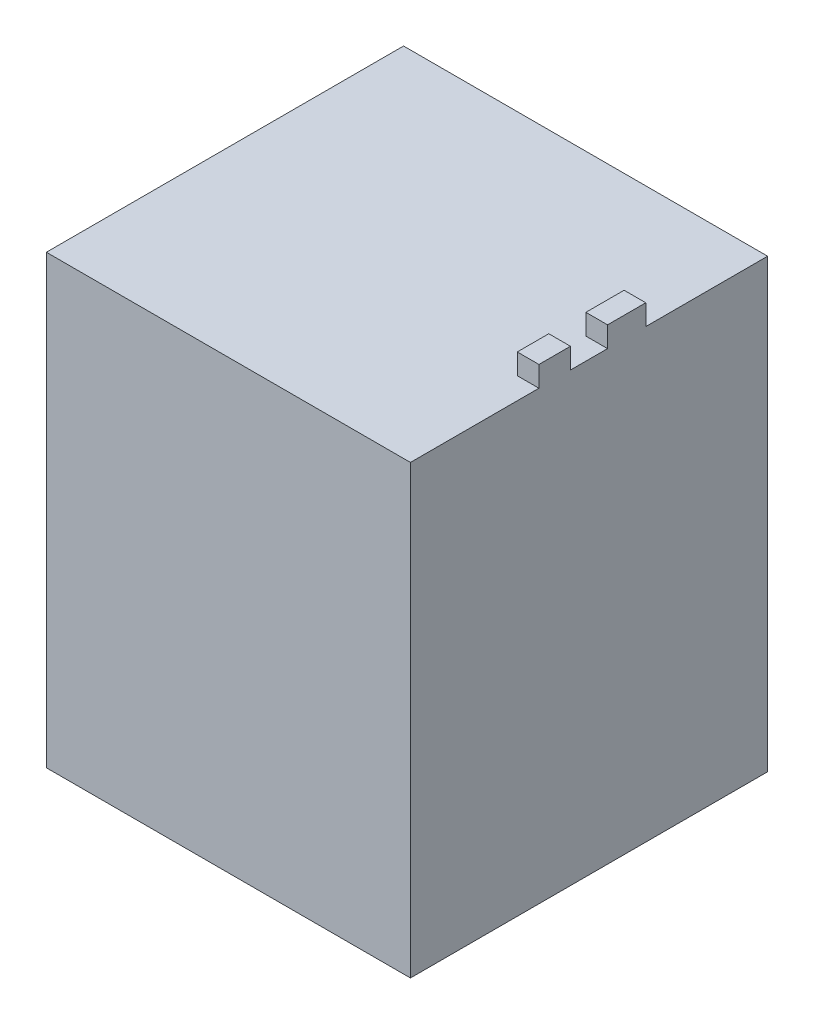
ISO-10303-21;
HEADER;
FILE_DESCRIPTION(('STEP AP214'),'2;1');
FILE_NAME('part.step','',(''),(''),'','','');
FILE_SCHEMA(('AUTOMOTIVE_DESIGN { 1 0 10303 214 1 1 1 1 }'));
ENDSEC;
DATA;
#1=APPLICATION_CONTEXT('core data for automotive mechanical design processes');
#2=APPLICATION_PROTOCOL_DEFINITION('international standard','automotive_design',2000,#1);
#3=PRODUCT_CONTEXT('',#1,'mechanical');
#4=PRODUCT('Part','Part','',(#3));
#5=PRODUCT_RELATED_PRODUCT_CATEGORY('part','',(#4));
#6=PRODUCT_DEFINITION_FORMATION('','',#4);
#7=PRODUCT_DEFINITION_CONTEXT('part definition',#1,'design');
#8=PRODUCT_DEFINITION('design','',#6,#7);
#9=PRODUCT_DEFINITION_SHAPE('','',#8);
#10=(LENGTH_UNIT() NAMED_UNIT(*) SI_UNIT(.MILLI.,.METRE.));
#11=(NAMED_UNIT(*) PLANE_ANGLE_UNIT() SI_UNIT($,.RADIAN.));
#12=(NAMED_UNIT(*) SI_UNIT($,.STERADIAN.) SOLID_ANGLE_UNIT());
#13=UNCERTAINTY_MEASURE_WITH_UNIT(LENGTH_MEASURE(1.E-05),#10,'distance_accuracy_value','');
#14=(GEOMETRIC_REPRESENTATION_CONTEXT(3) GLOBAL_UNCERTAINTY_ASSIGNED_CONTEXT((#13)) GLOBAL_UNIT_ASSIGNED_CONTEXT((#10,
#11,#12)) REPRESENTATION_CONTEXT('',''));
#15=CARTESIAN_POINT('',(0.,0.,0.));
#16=DIRECTION('',(0.,0.,1.));
#17=DIRECTION('',(1.,0.,0.));
#18=AXIS2_PLACEMENT_3D('',#15,#16,#17);
#19=CARTESIAN_POINT('',(0.,65.,0.));
#20=DIRECTION('',(0.,1.,0.));
#21=DIRECTION('',(0.,0.,1.));
#22=AXIS2_PLACEMENT_3D('',#19,#20,#21);
#23=PLANE('',#22);
#24=DIRECTION('',(0.,0.,1.));
#25=VECTOR('',#24,1.);
#26=CARTESIAN_POINT('',(37.4181346575853,65.,-10.1187209788094));
#27=LINE('',#26,#25);
#28=CARTESIAN_POINT('',(37.4181346575853,65.,-10.1187209788094));
#29=VERTEX_POINT('',#28);
#30=CARTESIAN_POINT('',(37.4181346575853,65.,-5.53067615751246));
#31=VERTEX_POINT('',#30);
#32=EDGE_CURVE('E354',#29,#31,#27,.T.);
#33=ORIENTED_EDGE('',*,*,#32,.F.);
#34=DIRECTION('',(-1.,0.,0.));
#35=VECTOR('',#34,1.);
#36=CARTESIAN_POINT('',(40.5734463276836,65.,-10.1187209788094));
#37=LINE('',#36,#35);
#38=CARTESIAN_POINT('',(40.5734463276836,65.,-10.1187209788094));
#39=VERTEX_POINT('',#38);
#40=EDGE_CURVE('E225',#39,#29,#37,.T.);
#41=ORIENTED_EDGE('',*,*,#40,.F.);
#42=DIRECTION('',(0.,0.,-1.));
#43=VECTOR('',#42,1.);
#44=CARTESIAN_POINT('',(40.5734463276836,65.,-38.8248587570622));
#45=LINE('',#44,#43);
#46=CARTESIAN_POINT('',(40.5734463276836,65.,-15.5208446142581));
#47=VERTEX_POINT('',#46);
#48=EDGE_CURVE('E149',#39,#47,#45,.T.);
#49=ORIENTED_EDGE('',*,*,#48,.T.);
#50=DIRECTION('',(1.,0.,0.));
#51=VECTOR('',#50,1.);
#52=CARTESIAN_POINT('',(40.5734463276836,65.,-15.5208446142581));
#53=LINE('',#52,#51);
#54=CARTESIAN_POINT('',(37.4181346575853,65.,-15.5208446142581));
#55=VERTEX_POINT('',#54);
#56=EDGE_CURVE('E59',#55,#47,#53,.T.);
#57=ORIENTED_EDGE('',*,*,#56,.F.);
#58=DIRECTION('',(0.,0.,1.));
#59=VECTOR('',#58,1.);
#60=CARTESIAN_POINT('',(37.4181346575853,65.,-21.0836012163469));
#61=LINE('',#60,#59);
#62=CARTESIAN_POINT('',(37.4181346575853,65.,-21.0836012163469));
#63=VERTEX_POINT('',#62);
#64=EDGE_CURVE('E153',#63,#55,#61,.T.);
#65=ORIENTED_EDGE('',*,*,#64,.F.);
#66=DIRECTION('',(-1.,0.,0.));
#67=VECTOR('',#66,1.);
#68=CARTESIAN_POINT('',(40.5734463276836,65.,-21.0836012163469));
#69=LINE('',#68,#67);
#70=CARTESIAN_POINT('',(40.5734463276836,65.,-21.0836012163469));
#71=VERTEX_POINT('',#70);
#72=EDGE_CURVE('E150',#71,#63,#69,.T.);
#73=ORIENTED_EDGE('',*,*,#72,.F.);
#74=CARTESIAN_POINT('',(40.5734463276836,65.,-38.8248587570622));
#75=VERTEX_POINT('',#74);
#76=EDGE_CURVE('E187',#71,#75,#45,.T.);
#77=ORIENTED_EDGE('',*,*,#76,.T.);
#78=DIRECTION('',(-1.,0.,0.));
#79=VECTOR('',#78,1.);
#80=CARTESIAN_POINT('',(-12.4265536723164,65.,-38.8248587570622));
#81=LINE('',#80,#79);
#82=CARTESIAN_POINT('',(-12.4265536723164,65.,-38.8248587570622));
#83=VERTEX_POINT('',#82);
#84=EDGE_CURVE('E191',#75,#83,#81,.T.);
#85=ORIENTED_EDGE('',*,*,#84,.T.);
#86=DIRECTION('',(0.,0.,1.));
#87=VECTOR('',#86,1.);
#88=CARTESIAN_POINT('',(-12.4265536723164,65.,-38.8248587570622));
#89=LINE('',#88,#87);
#90=CARTESIAN_POINT('',(-12.4265536723164,65.,13.1751412429378));
#91=VERTEX_POINT('',#90);
#92=EDGE_CURVE('E181',#83,#91,#89,.T.);
#93=ORIENTED_EDGE('',*,*,#92,.T.);
#94=DIRECTION('',(1.,0.,0.));
#95=VECTOR('',#94,1.);
#96=CARTESIAN_POINT('',(-12.4265536723164,65.,13.1751412429378));
#97=LINE('',#96,#95);
#98=CARTESIAN_POINT('',(40.5734463276836,65.,13.1751412429378));
#99=VERTEX_POINT('',#98);
#100=EDGE_CURVE('E184',#91,#99,#97,.T.);
#101=ORIENTED_EDGE('',*,*,#100,.T.);
#102=CARTESIAN_POINT('',(40.5734463276836,65.,-5.53067615751246));
#103=VERTEX_POINT('',#102);
#104=EDGE_CURVE('E188',#99,#103,#45,.T.);
#105=ORIENTED_EDGE('',*,*,#104,.T.);
#106=DIRECTION('',(1.,0.,0.));
#107=VECTOR('',#106,1.);
#108=CARTESIAN_POINT('',(40.5734463276836,65.,-5.53067615751246));
#109=LINE('',#108,#107);
#110=EDGE_CURVE('E144',#31,#103,#109,.T.);
#111=ORIENTED_EDGE('',*,*,#110,.F.);
#112=EDGE_LOOP('',(#33,#41,#49,#57,#65,#73,#77,#85,#93,#101,#105,#111));
#113=FACE_BOUND('',#112,.T.);
#114=ADVANCED_FACE('F36',(#113),#23,.T.);
#115=CARTESIAN_POINT('',(-12.4265536723164,65.,-38.8248587570622));
#116=DIRECTION('',(1.,0.,0.));
#117=DIRECTION('',(0.,0.,-1.));
#118=AXIS2_PLACEMENT_3D('',#115,#116,#117);
#119=PLANE('',#118);
#120=DIRECTION('',(0.,0.,1.));
#121=VECTOR('',#120,1.);
#122=CARTESIAN_POINT('',(-12.4265536723164,0.,-38.8248587570622));
#123=LINE('',#122,#121);
#124=CARTESIAN_POINT('',(-12.4265536723164,0.,-38.8248587570622));
#125=VERTEX_POINT('',#124);
#126=CARTESIAN_POINT('',(-12.4265536723164,0.,13.1751412429378));
#127=VERTEX_POINT('',#126);
#128=EDGE_CURVE('E180',#125,#127,#123,.T.);
#129=ORIENTED_EDGE('',*,*,#128,.T.);
#130=DIRECTION('',(0.,-1.,0.));
#131=VECTOR('',#130,1.);
#132=CARTESIAN_POINT('',(-12.4265536723164,65.,13.1751412429378));
#133=LINE('',#132,#131);
#134=EDGE_CURVE('E11',#91,#127,#133,.T.);
#135=ORIENTED_EDGE('',*,*,#134,.F.);
#136=ORIENTED_EDGE('',*,*,#92,.F.);
#137=DIRECTION('',(0.,-1.,0.));
#138=VECTOR('',#137,1.);
#139=CARTESIAN_POINT('',(-12.4265536723164,65.,-38.8248587570622));
#140=LINE('',#139,#138);
#141=EDGE_CURVE('E193',#83,#125,#140,.T.);
#142=ORIENTED_EDGE('',*,*,#141,.T.);
#143=EDGE_LOOP('',(#129,#135,#136,#142));
#144=FACE_BOUND('',#143,.T.);
#145=ADVANCED_FACE('F38',(#144),#119,.F.);
#146=CARTESIAN_POINT('',(-12.4265536723164,65.,13.1751412429378));
#147=DIRECTION('',(0.,0.,-1.));
#148=DIRECTION('',(-1.,0.,0.));
#149=AXIS2_PLACEMENT_3D('',#146,#147,#148);
#150=PLANE('',#149);
#151=DIRECTION('',(1.,0.,0.));
#152=VECTOR('',#151,1.);
#153=CARTESIAN_POINT('',(-12.4265536723164,0.,13.1751412429378));
#154=LINE('',#153,#152);
#155=CARTESIAN_POINT('',(40.5734463276836,0.,13.1751412429378));
#156=VERTEX_POINT('',#155);
#157=EDGE_CURVE('E196',#127,#156,#154,.T.);
#158=ORIENTED_EDGE('',*,*,#157,.T.);
#159=DIRECTION('',(0.,-1.,0.));
#160=VECTOR('',#159,1.);
#161=CARTESIAN_POINT('',(40.5734463276836,65.,13.1751412429378));
#162=LINE('',#161,#160);
#163=EDGE_CURVE('E44',#99,#156,#162,.T.);
#164=ORIENTED_EDGE('',*,*,#163,.F.);
#165=ORIENTED_EDGE('',*,*,#100,.F.);
#166=ORIENTED_EDGE('',*,*,#134,.T.);
#167=EDGE_LOOP('',(#158,#164,#165,#166));
#168=FACE_BOUND('',#167,.T.);
#169=ADVANCED_FACE('F253',(#168),#150,.F.);
#170=CARTESIAN_POINT('',(40.5734463276836,65.,-38.8248587570622));
#171=DIRECTION('',(-1.,0.,0.));
#172=DIRECTION('',(0.,0.,1.));
#173=AXIS2_PLACEMENT_3D('',#170,#171,#172);
#174=PLANE('',#173);
#175=DIRECTION('',(0.,0.,-1.));
#176=VECTOR('',#175,1.);
#177=CARTESIAN_POINT('',(40.5734463276836,0.,-38.8248587570622));
#178=LINE('',#177,#176);
#179=CARTESIAN_POINT('',(40.5734463276836,0.,-38.8248587570622));
#180=VERTEX_POINT('',#179);
#181=EDGE_CURVE('E198',#156,#180,#178,.T.);
#182=ORIENTED_EDGE('',*,*,#181,.T.);
#183=DIRECTION('',(0.,-1.,0.));
#184=VECTOR('',#183,1.);
#185=CARTESIAN_POINT('',(40.5734463276836,65.,-38.8248587570622));
#186=LINE('',#185,#184);
#187=EDGE_CURVE('E203',#75,#180,#186,.T.);
#188=ORIENTED_EDGE('',*,*,#187,.F.);
#189=ORIENTED_EDGE('',*,*,#76,.F.);
#190=DIRECTION('',(0.,-1.,0.));
#191=VECTOR('',#190,1.);
#192=CARTESIAN_POINT('',(40.5734463276836,68.,-21.0836012163469));
#193=LINE('',#192,#191);
#194=CARTESIAN_POINT('',(40.5734463276836,68.,-21.0836012163469));
#195=VERTEX_POINT('',#194);
#196=EDGE_CURVE('E177',#195,#71,#193,.T.);
#197=ORIENTED_EDGE('',*,*,#196,.F.);
#198=DIRECTION('',(0.,0.,-1.));
#199=VECTOR('',#198,1.);
#200=CARTESIAN_POINT('',(40.5734463276836,68.,-21.0836012163469));
#201=LINE('',#200,#199);
#202=CARTESIAN_POINT('',(40.5734463276836,68.,-15.5208446142581));
#203=VERTEX_POINT('',#202);
#204=EDGE_CURVE('E158',#203,#195,#201,.T.);
#205=ORIENTED_EDGE('',*,*,#204,.F.);
#206=DIRECTION('',(0.,-1.,0.));
#207=VECTOR('',#206,1.);
#208=CARTESIAN_POINT('',(40.5734463276836,68.,-15.5208446142581));
#209=LINE('',#208,#207);
#210=EDGE_CURVE('E166',#203,#47,#209,.T.);
#211=ORIENTED_EDGE('',*,*,#210,.T.);
#212=ORIENTED_EDGE('',*,*,#48,.F.);
#213=DIRECTION('',(0.,-1.,0.));
#214=VECTOR('',#213,1.);
#215=CARTESIAN_POINT('',(40.5734463276836,68.,-10.1187209788094));
#216=LINE('',#215,#214);
#217=CARTESIAN_POINT('',(40.5734463276836,68.,-10.1187209788094));
#218=VERTEX_POINT('',#217);
#219=EDGE_CURVE('E129',#218,#39,#216,.T.);
#220=ORIENTED_EDGE('',*,*,#219,.F.);
#221=DIRECTION('',(0.,0.,-1.));
#222=VECTOR('',#221,1.);
#223=CARTESIAN_POINT('',(40.5734463276836,68.,-10.1187209788094));
#224=LINE('',#223,#222);
#225=CARTESIAN_POINT('',(40.5734463276836,68.,-5.53067615751246));
#226=VERTEX_POINT('',#225);
#227=EDGE_CURVE('E136',#226,#218,#224,.T.);
#228=ORIENTED_EDGE('',*,*,#227,.F.);
#229=DIRECTION('',(0.,-1.,0.));
#230=VECTOR('',#229,1.);
#231=CARTESIAN_POINT('',(40.5734463276836,68.,-5.53067615751246));
#232=LINE('',#231,#230);
#233=EDGE_CURVE('E353',#226,#103,#232,.T.);
#234=ORIENTED_EDGE('',*,*,#233,.T.);
#235=ORIENTED_EDGE('',*,*,#104,.F.);
#236=ORIENTED_EDGE('',*,*,#163,.T.);
#237=EDGE_LOOP('',(#182,#188,#189,#197,#205,#211,#212,#220,#228,#234,#235,#236));
#238=FACE_BOUND('',#237,.T.);
#239=ADVANCED_FACE('F147',(#238),#174,.F.);
#240=CARTESIAN_POINT('',(-12.4265536723164,65.,-38.8248587570622));
#241=DIRECTION('',(0.,0.,1.));
#242=DIRECTION('',(1.,0.,0.));
#243=AXIS2_PLACEMENT_3D('',#240,#241,#242);
#244=PLANE('',#243);
#245=DIRECTION('',(-1.,0.,0.));
#246=VECTOR('',#245,1.);
#247=CARTESIAN_POINT('',(-12.4265536723164,0.,-38.8248587570622));
#248=LINE('',#247,#246);
#249=EDGE_CURVE('E185',#180,#125,#248,.T.);
#250=ORIENTED_EDGE('',*,*,#249,.T.);
#251=ORIENTED_EDGE('',*,*,#141,.F.);
#252=ORIENTED_EDGE('',*,*,#84,.F.);
#253=ORIENTED_EDGE('',*,*,#187,.T.);
#254=EDGE_LOOP('',(#250,#251,#252,#253));
#255=FACE_BOUND('',#254,.T.);
#256=ADVANCED_FACE('F217',(#255),#244,.F.);
#257=CARTESIAN_POINT('',(0.,0.,0.));
#258=DIRECTION('',(0.,1.,0.));
#259=DIRECTION('',(0.,0.,1.));
#260=AXIS2_PLACEMENT_3D('',#257,#258,#259);
#261=PLANE('',#260);
#262=ORIENTED_EDGE('',*,*,#128,.F.);
#263=ORIENTED_EDGE('',*,*,#249,.F.);
#264=ORIENTED_EDGE('',*,*,#181,.F.);
#265=ORIENTED_EDGE('',*,*,#157,.F.);
#266=EDGE_LOOP('',(#262,#263,#264,#265));
#267=FACE_BOUND('',#266,.T.);
#268=ADVANCED_FACE('F214',(#267),#261,.F.);
#269=CARTESIAN_POINT('',(40.5734463276836,68.,-21.0836012163469));
#270=DIRECTION('',(0.,0.,1.));
#271=DIRECTION('',(1.,0.,0.));
#272=AXIS2_PLACEMENT_3D('',#269,#270,#271);
#273=PLANE('',#272);
#274=ORIENTED_EDGE('',*,*,#72,.T.);
#275=DIRECTION('',(0.,-1.,0.));
#276=VECTOR('',#275,1.);
#277=CARTESIAN_POINT('',(37.4181346575853,68.,-21.0836012163469));
#278=LINE('',#277,#276);
#279=CARTESIAN_POINT('',(37.4181346575853,68.,-21.0836012163469));
#280=VERTEX_POINT('',#279);
#281=EDGE_CURVE('E174',#280,#63,#278,.T.);
#282=ORIENTED_EDGE('',*,*,#281,.F.);
#283=DIRECTION('',(-1.,0.,0.));
#284=VECTOR('',#283,1.);
#285=CARTESIAN_POINT('',(40.5734463276836,68.,-21.0836012163469));
#286=LINE('',#285,#284);
#287=EDGE_CURVE('E161',#195,#280,#286,.T.);
#288=ORIENTED_EDGE('',*,*,#287,.F.);
#289=ORIENTED_EDGE('',*,*,#196,.T.);
#290=EDGE_LOOP('',(#274,#282,#288,#289));
#291=FACE_BOUND('',#290,.T.);
#292=ADVANCED_FACE('F239',(#291),#273,.F.);
#293=CARTESIAN_POINT('',(37.4181346575853,68.,-21.0836012163469));
#294=DIRECTION('',(1.,0.,0.));
#295=DIRECTION('',(0.,0.,-1.));
#296=AXIS2_PLACEMENT_3D('',#293,#294,#295);
#297=PLANE('',#296);
#298=ORIENTED_EDGE('',*,*,#64,.T.);
#299=DIRECTION('',(0.,-1.,0.));
#300=VECTOR('',#299,1.);
#301=CARTESIAN_POINT('',(37.4181346575853,68.,-15.5208446142581));
#302=LINE('',#301,#300);
#303=CARTESIAN_POINT('',(37.4181346575853,68.,-15.5208446142581));
#304=VERTEX_POINT('',#303);
#305=EDGE_CURVE('E171',#304,#55,#302,.T.);
#306=ORIENTED_EDGE('',*,*,#305,.F.);
#307=DIRECTION('',(0.,0.,1.));
#308=VECTOR('',#307,1.);
#309=CARTESIAN_POINT('',(37.4181346575853,68.,-21.0836012163469));
#310=LINE('',#309,#308);
#311=EDGE_CURVE('E163',#280,#304,#310,.T.);
#312=ORIENTED_EDGE('',*,*,#311,.F.);
#313=ORIENTED_EDGE('',*,*,#281,.T.);
#314=EDGE_LOOP('',(#298,#306,#312,#313));
#315=FACE_BOUND('',#314,.T.);
#316=ADVANCED_FACE('F237',(#315),#297,.F.);
#317=CARTESIAN_POINT('',(40.5734463276836,68.,-15.5208446142581));
#318=DIRECTION('',(0.,0.,-1.));
#319=DIRECTION('',(-1.,0.,0.));
#320=AXIS2_PLACEMENT_3D('',#317,#318,#319);
#321=PLANE('',#320);
#322=ORIENTED_EDGE('',*,*,#56,.T.);
#323=ORIENTED_EDGE('',*,*,#210,.F.);
#324=DIRECTION('',(1.,0.,0.));
#325=VECTOR('',#324,1.);
#326=CARTESIAN_POINT('',(40.5734463276836,68.,-15.5208446142581));
#327=LINE('',#326,#325);
#328=EDGE_CURVE('E165',#304,#203,#327,.T.);
#329=ORIENTED_EDGE('',*,*,#328,.F.);
#330=ORIENTED_EDGE('',*,*,#305,.T.);
#331=EDGE_LOOP('',(#322,#323,#329,#330));
#332=FACE_BOUND('',#331,.T.);
#333=ADVANCED_FACE('F228',(#332),#321,.F.);
#334=CARTESIAN_POINT('',(0.,68.,0.));
#335=DIRECTION('',(0.,-1.,0.));
#336=DIRECTION('',(0.,0.,-1.));
#337=AXIS2_PLACEMENT_3D('',#334,#335,#336);
#338=PLANE('',#337);
#339=ORIENTED_EDGE('',*,*,#204,.T.);
#340=ORIENTED_EDGE('',*,*,#287,.T.);
#341=ORIENTED_EDGE('',*,*,#311,.T.);
#342=ORIENTED_EDGE('',*,*,#328,.T.);
#343=EDGE_LOOP('',(#339,#340,#341,#342));
#344=FACE_BOUND('',#343,.T.);
#345=ADVANCED_FACE('F233',(#344),#338,.F.);
#346=CARTESIAN_POINT('',(40.5734463276836,68.,-10.1187209788094));
#347=DIRECTION('',(0.,0.,1.));
#348=DIRECTION('',(1.,0.,0.));
#349=AXIS2_PLACEMENT_3D('',#346,#347,#348);
#350=PLANE('',#349);
#351=ORIENTED_EDGE('',*,*,#40,.T.);
#352=DIRECTION('',(0.,-1.,0.));
#353=VECTOR('',#352,1.);
#354=CARTESIAN_POINT('',(37.4181346575853,68.,-10.1187209788094));
#355=LINE('',#354,#353);
#356=CARTESIAN_POINT('',(37.4181346575853,68.,-10.1187209788094));
#357=VERTEX_POINT('',#356);
#358=EDGE_CURVE('E132',#357,#29,#355,.T.);
#359=ORIENTED_EDGE('',*,*,#358,.F.);
#360=DIRECTION('',(-1.,0.,0.));
#361=VECTOR('',#360,1.);
#362=CARTESIAN_POINT('',(40.5734463276836,68.,-10.1187209788094));
#363=LINE('',#362,#361);
#364=EDGE_CURVE('E125',#218,#357,#363,.T.);
#365=ORIENTED_EDGE('',*,*,#364,.F.);
#366=ORIENTED_EDGE('',*,*,#219,.T.);
#367=EDGE_LOOP('',(#351,#359,#365,#366));
#368=FACE_BOUND('',#367,.T.);
#369=ADVANCED_FACE('F127',(#368),#350,.F.);
#370=CARTESIAN_POINT('',(37.4181346575853,68.,-10.1187209788094));
#371=DIRECTION('',(1.,0.,0.));
#372=DIRECTION('',(0.,0.,-1.));
#373=AXIS2_PLACEMENT_3D('',#370,#371,#372);
#374=PLANE('',#373);
#375=ORIENTED_EDGE('',*,*,#32,.T.);
#376=DIRECTION('',(0.,-1.,0.));
#377=VECTOR('',#376,1.);
#378=CARTESIAN_POINT('',(37.4181346575853,68.,-5.53067615751246));
#379=LINE('',#378,#377);
#380=CARTESIAN_POINT('',(37.4181346575853,68.,-5.53067615751246));
#381=VERTEX_POINT('',#380);
#382=EDGE_CURVE('E51',#381,#31,#379,.T.);
#383=ORIENTED_EDGE('',*,*,#382,.F.);
#384=DIRECTION('',(0.,0.,1.));
#385=VECTOR('',#384,1.);
#386=CARTESIAN_POINT('',(37.4181346575853,68.,-10.1187209788094));
#387=LINE('',#386,#385);
#388=EDGE_CURVE('E135',#357,#381,#387,.T.);
#389=ORIENTED_EDGE('',*,*,#388,.F.);
#390=ORIENTED_EDGE('',*,*,#358,.T.);
#391=EDGE_LOOP('',(#375,#383,#389,#390));
#392=FACE_BOUND('',#391,.T.);
#393=ADVANCED_FACE('F320',(#392),#374,.F.);
#394=CARTESIAN_POINT('',(40.5734463276836,68.,-5.53067615751246));
#395=DIRECTION('',(0.,0.,-1.));
#396=DIRECTION('',(-1.,0.,0.));
#397=AXIS2_PLACEMENT_3D('',#394,#395,#396);
#398=PLANE('',#397);
#399=ORIENTED_EDGE('',*,*,#110,.T.);
#400=ORIENTED_EDGE('',*,*,#233,.F.);
#401=DIRECTION('',(1.,0.,0.));
#402=VECTOR('',#401,1.);
#403=CARTESIAN_POINT('',(40.5734463276836,68.,-5.53067615751246));
#404=LINE('',#403,#402);
#405=EDGE_CURVE('E140',#381,#226,#404,.T.);
#406=ORIENTED_EDGE('',*,*,#405,.F.);
#407=ORIENTED_EDGE('',*,*,#382,.T.);
#408=EDGE_LOOP('',(#399,#400,#406,#407));
#409=FACE_BOUND('',#408,.T.);
#410=ADVANCED_FACE('F328',(#409),#398,.F.);
#411=CARTESIAN_POINT('',(0.,68.,0.));
#412=DIRECTION('',(0.,-1.,0.));
#413=DIRECTION('',(0.,0.,-1.));
#414=AXIS2_PLACEMENT_3D('',#411,#412,#413);
#415=PLANE('',#414);
#416=ORIENTED_EDGE('',*,*,#227,.T.);
#417=ORIENTED_EDGE('',*,*,#364,.T.);
#418=ORIENTED_EDGE('',*,*,#388,.T.);
#419=ORIENTED_EDGE('',*,*,#405,.T.);
#420=EDGE_LOOP('',(#416,#417,#418,#419));
#421=FACE_BOUND('',#420,.T.);
#422=ADVANCED_FACE('F139',(#421),#415,.F.);
#423=CLOSED_SHELL('',(#114,#145,#169,#239,#256,#268,#292,#316,#333,#345,#369,#393,#410,#422));
#424=MANIFOLD_SOLID_BREP('B2',#423);
#425=ADVANCED_BREP_SHAPE_REPRESENTATION('',(#18,#424),#14);
#426=SHAPE_DEFINITION_REPRESENTATION(#9,#425);
ENDSEC;
END-ISO-10303-21;
